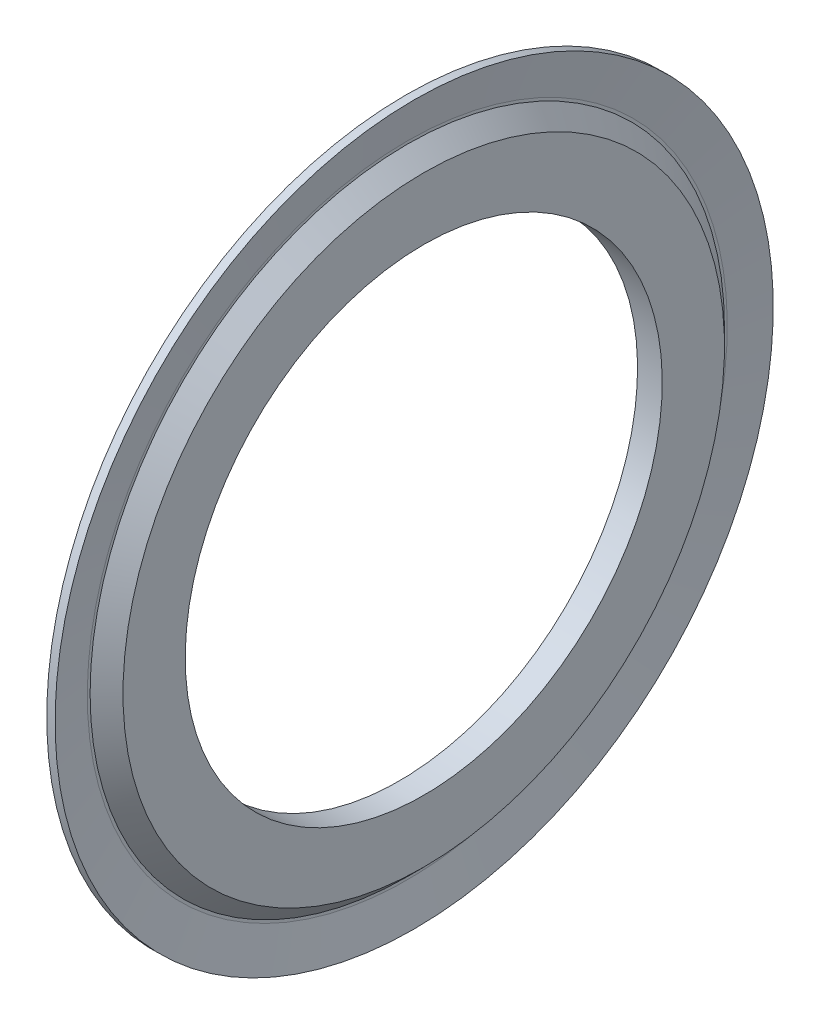
ISO-10303-21;
HEADER;
FILE_DESCRIPTION(('STEP AP214'),'2;1');
FILE_NAME('part.step','',(''),(''),'','','');
FILE_SCHEMA(('AUTOMOTIVE_DESIGN { 1 0 10303 214 1 1 1 1 }'));
ENDSEC;
DATA;
#1=APPLICATION_CONTEXT('core data for automotive mechanical design processes');
#2=APPLICATION_PROTOCOL_DEFINITION('international standard','automotive_design',2000,#1);
#3=PRODUCT_CONTEXT('',#1,'mechanical');
#4=PRODUCT('Part','Part','',(#3));
#5=PRODUCT_RELATED_PRODUCT_CATEGORY('part','',(#4));
#6=PRODUCT_DEFINITION_FORMATION('','',#4);
#7=PRODUCT_DEFINITION_CONTEXT('part definition',#1,'design');
#8=PRODUCT_DEFINITION('design','',#6,#7);
#9=PRODUCT_DEFINITION_SHAPE('','',#8);
#10=(LENGTH_UNIT() NAMED_UNIT(*) SI_UNIT(.MILLI.,.METRE.));
#11=(NAMED_UNIT(*) PLANE_ANGLE_UNIT() SI_UNIT($,.RADIAN.));
#12=(NAMED_UNIT(*) SI_UNIT($,.STERADIAN.) SOLID_ANGLE_UNIT());
#13=UNCERTAINTY_MEASURE_WITH_UNIT(LENGTH_MEASURE(1.E-05),#10,'distance_accuracy_value','');
#14=(GEOMETRIC_REPRESENTATION_CONTEXT(3) GLOBAL_UNCERTAINTY_ASSIGNED_CONTEXT((#13)) GLOBAL_UNIT_ASSIGNED_CONTEXT((#10,
#11,#12)) REPRESENTATION_CONTEXT('',''));
#15=CARTESIAN_POINT('',(0.,0.,0.));
#16=DIRECTION('',(0.,0.,1.));
#17=DIRECTION('',(1.,0.,0.));
#18=AXIS2_PLACEMENT_3D('',#15,#16,#17);
#19=CARTESIAN_POINT('',(5.2371286845165,7.518,0.));
#20=DIRECTION('',(-1.,0.,0.));
#21=DIRECTION('',(0.,-1.,0.));
#22=AXIS2_PLACEMENT_3D('',#19,#20,#21);
#23=PLANE('',#22);
#24=CARTESIAN_POINT('',(5.2371286845165,0.,0.));
#25=DIRECTION('',(1.,0.,0.));
#26=DIRECTION('',(0.,1.,0.));
#27=AXIS2_PLACEMENT_3D('',#24,#25,#26);
#28=CIRCLE('',#27,7.436);
#29=CARTESIAN_POINT('',(5.2371286845165,7.436,0.));
#30=VERTEX_POINT('',#29);
#31=EDGE_CURVE('E11',#30,#30,#28,.T.);
#32=ORIENTED_EDGE('',*,*,#31,.T.);
#33=EDGE_LOOP('',(#32));
#34=FACE_BOUND('',#33,.T.);
#35=CARTESIAN_POINT('',(5.2371286845165,0.,0.));
#36=DIRECTION('',(1.,0.,0.));
#37=DIRECTION('',(0.,1.,0.));
#38=AXIS2_PLACEMENT_3D('',#35,#36,#37);
#39=CIRCLE('',#38,7.6);
#40=CARTESIAN_POINT('',(5.2371286845165,7.6,0.));
#41=VERTEX_POINT('',#40);
#42=EDGE_CURVE('E70',#41,#41,#39,.T.);
#43=ORIENTED_EDGE('',*,*,#42,.F.);
#44=EDGE_LOOP('',(#43));
#45=FACE_BOUND('',#44,.T.);
#46=ADVANCED_FACE('F16',(#34,#45),#23,.T.);
#47=CARTESIAN_POINT('',(5.4321286845165,0.,0.));
#48=DIRECTION('',(-1.,0.,0.));
#49=DIRECTION('',(0.,1.,0.));
#50=AXIS2_PLACEMENT_3D('',#47,#48,#49);
#51=CONICAL_SURFACE('',#50,7.241,0.785398163397447);
#52=CARTESIAN_POINT('',(5.6271286845165,0.,0.));
#53=DIRECTION('',(1.,0.,0.));
#54=DIRECTION('',(0.,1.,0.));
#55=AXIS2_PLACEMENT_3D('',#52,#53,#54);
#56=CIRCLE('',#55,7.046);
#57=CARTESIAN_POINT('',(5.6271286845165,7.046,0.));
#58=VERTEX_POINT('',#57);
#59=EDGE_CURVE('E26',#58,#58,#56,.T.);
#60=ORIENTED_EDGE('',*,*,#59,.T.);
#61=EDGE_LOOP('',(#60));
#62=FACE_BOUND('',#61,.T.);
#63=ORIENTED_EDGE('',*,*,#31,.F.);
#64=EDGE_LOOP('',(#63));
#65=FACE_BOUND('',#64,.T.);
#66=ADVANCED_FACE('F18',(#62,#65),#51,.F.);
#67=CARTESIAN_POINT('',(5.6271286845165,6.44675,0.));
#68=DIRECTION('',(-1.,0.,0.));
#69=DIRECTION('',(0.,-1.,0.));
#70=AXIS2_PLACEMENT_3D('',#67,#68,#69);
#71=PLANE('',#70);
#72=CARTESIAN_POINT('',(5.6271286845165,0.,0.));
#73=DIRECTION('',(1.,0.,0.));
#74=DIRECTION('',(0.,1.,0.));
#75=AXIS2_PLACEMENT_3D('',#72,#73,#74);
#76=CIRCLE('',#75,5.8475);
#77=CARTESIAN_POINT('',(5.6271286845165,5.8475,0.));
#78=VERTEX_POINT('',#77);
#79=EDGE_CURVE('E85',#78,#78,#76,.T.);
#80=ORIENTED_EDGE('',*,*,#79,.T.);
#81=EDGE_LOOP('',(#80));
#82=FACE_BOUND('',#81,.T.);
#83=ORIENTED_EDGE('',*,*,#59,.F.);
#84=EDGE_LOOP('',(#83));
#85=FACE_BOUND('',#84,.T.);
#86=ADVANCED_FACE('F105',(#82,#85),#71,.T.);
#87=CARTESIAN_POINT('',(5.4321286845165,0.,0.));
#88=DIRECTION('',(-1.,0.,0.));
#89=DIRECTION('',(0.,1.,0.));
#90=AXIS2_PLACEMENT_3D('',#87,#88,#89);
#91=CYLINDRICAL_SURFACE('',#90,5.8475);
#92=CARTESIAN_POINT('',(5.2371286845165,0.,0.));
#93=DIRECTION('',(1.,0.,0.));
#94=DIRECTION('',(0.,1.,0.));
#95=AXIS2_PLACEMENT_3D('',#92,#93,#94);
#96=CIRCLE('',#95,5.8475);
#97=CARTESIAN_POINT('',(5.2371286845165,5.8475,0.));
#98=VERTEX_POINT('',#97);
#99=EDGE_CURVE('E86',#98,#98,#96,.T.);
#100=ORIENTED_EDGE('',*,*,#99,.T.);
#101=EDGE_LOOP('',(#100));
#102=FACE_BOUND('',#101,.T.);
#103=ORIENTED_EDGE('',*,*,#79,.F.);
#104=EDGE_LOOP('',(#103));
#105=FACE_BOUND('',#104,.T.);
#106=ADVANCED_FACE('F91',(#102,#105),#91,.T.);
#107=CARTESIAN_POINT('',(5.2371286845165,5.75,0.));
#108=DIRECTION('',(-1.,0.,0.));
#109=DIRECTION('',(0.,-1.,0.));
#110=AXIS2_PLACEMENT_3D('',#107,#108,#109);
#111=PLANE('',#110);
#112=CARTESIAN_POINT('',(5.2371286845165,0.,0.));
#113=DIRECTION('',(1.,0.,0.));
#114=DIRECTION('',(0.,1.,0.));
#115=AXIS2_PLACEMENT_3D('',#112,#113,#114);
#116=CIRCLE('',#115,5.6525);
#117=CARTESIAN_POINT('',(5.2371286845165,5.6525,0.));
#118=VERTEX_POINT('',#117);
#119=EDGE_CURVE('E66',#118,#118,#116,.T.);
#120=ORIENTED_EDGE('',*,*,#119,.T.);
#121=EDGE_LOOP('',(#120));
#122=FACE_BOUND('',#121,.T.);
#123=ORIENTED_EDGE('',*,*,#99,.F.);
#124=EDGE_LOOP('',(#123));
#125=FACE_BOUND('',#124,.T.);
#126=ADVANCED_FACE('F94',(#122,#125),#111,.T.);
#127=CARTESIAN_POINT('',(5.5296286845165,0.,0.));
#128=DIRECTION('',(-1.,0.,0.));
#129=DIRECTION('',(0.,1.,0.));
#130=AXIS2_PLACEMENT_3D('',#127,#128,#129);
#131=CYLINDRICAL_SURFACE('',#130,5.6525);
#132=CARTESIAN_POINT('',(5.8221286845165,0.,0.));
#133=DIRECTION('',(1.,0.,0.));
#134=DIRECTION('',(0.,1.,0.));
#135=AXIS2_PLACEMENT_3D('',#132,#133,#134);
#136=CIRCLE('',#135,5.6525);
#137=CARTESIAN_POINT('',(5.8221286845165,5.6525,0.));
#138=VERTEX_POINT('',#137);
#139=EDGE_CURVE('E63',#138,#138,#136,.T.);
#140=ORIENTED_EDGE('',*,*,#139,.T.);
#141=EDGE_LOOP('',(#140));
#142=FACE_BOUND('',#141,.T.);
#143=ORIENTED_EDGE('',*,*,#119,.F.);
#144=EDGE_LOOP('',(#143));
#145=FACE_BOUND('',#144,.T.);
#146=ADVANCED_FACE('F96',(#142,#145),#131,.F.);
#147=CARTESIAN_POINT('',(5.8221286845165,6.38963582233138,0.));
#148=DIRECTION('',(1.,0.,0.));
#149=DIRECTION('',(0.,1.,0.));
#150=AXIS2_PLACEMENT_3D('',#147,#148,#149);
#151=PLANE('',#150);
#152=CARTESIAN_POINT('',(5.8221286845165,0.,0.));
#153=DIRECTION('',(1.,0.,0.));
#154=DIRECTION('',(0.,1.,0.));
#155=AXIS2_PLACEMENT_3D('',#152,#153,#154);
#156=CIRCLE('',#155,7.12677164466275);
#157=CARTESIAN_POINT('',(5.8221286845165,7.12677164466275,0.));
#158=VERTEX_POINT('',#157);
#159=EDGE_CURVE('E59',#158,#158,#156,.T.);
#160=ORIENTED_EDGE('',*,*,#159,.T.);
#161=EDGE_LOOP('',(#160));
#162=FACE_BOUND('',#161,.T.);
#163=ORIENTED_EDGE('',*,*,#139,.F.);
#164=EDGE_LOOP('',(#163));
#165=FACE_BOUND('',#164,.T.);
#166=ADVANCED_FACE('F60',(#162,#165),#151,.T.);
#167=CARTESIAN_POINT('',(5.6271286845165,0.,0.));
#168=DIRECTION('',(-1.,0.,0.));
#169=DIRECTION('',(0.,1.,0.));
#170=AXIS2_PLACEMENT_3D('',#167,#168,#169);
#171=CONICAL_SURFACE('',#170,7.32177164466275,0.785398163397447);
#172=CARTESIAN_POINT('',(5.4321286845165,0.,0.));
#173=DIRECTION('',(1.,0.,0.));
#174=DIRECTION('',(0.,1.,0.));
#175=AXIS2_PLACEMENT_3D('',#172,#173,#174);
#176=CIRCLE('',#175,7.51677164466275);
#177=CARTESIAN_POINT('',(5.4321286845165,7.51677164466275,0.));
#178=VERTEX_POINT('',#177);
#179=EDGE_CURVE('E64',#178,#178,#176,.T.);
#180=ORIENTED_EDGE('',*,*,#179,.T.);
#181=EDGE_LOOP('',(#180));
#182=FACE_BOUND('',#181,.T.);
#183=ORIENTED_EDGE('',*,*,#159,.F.);
#184=EDGE_LOOP('',(#183));
#185=FACE_BOUND('',#184,.T.);
#186=ADVANCED_FACE('F130',(#182,#185),#171,.T.);
#187=CARTESIAN_POINT('',(5.4321286845165,7.5498556776376,0.));
#188=DIRECTION('',(1.,0.,0.));
#189=DIRECTION('',(0.,1.,0.));
#190=AXIS2_PLACEMENT_3D('',#187,#188,#189);
#191=PLANE('',#190);
#192=CARTESIAN_POINT('',(5.4321286845165,0.,0.));
#193=DIRECTION('',(1.,0.,0.));
#194=DIRECTION('',(0.,1.,0.));
#195=AXIS2_PLACEMENT_3D('',#192,#193,#194);
#196=CIRCLE('',#195,7.58293971061244);
#197=CARTESIAN_POINT('',(5.4321286845165,7.58293971061244,0.));
#198=VERTEX_POINT('',#197);
#199=EDGE_CURVE('E20',#198,#198,#196,.T.);
#200=ORIENTED_EDGE('',*,*,#199,.T.);
#201=EDGE_LOOP('',(#200));
#202=FACE_BOUND('',#201,.T.);
#203=ORIENTED_EDGE('',*,*,#179,.F.);
#204=EDGE_LOOP('',(#203));
#205=FACE_BOUND('',#204,.T.);
#206=ADVANCED_FACE('F122',(#202,#205),#191,.T.);
#207=CARTESIAN_POINT('',(5.51386155539771,0.,0.));
#208=DIRECTION('',(1.,0.,0.));
#209=DIRECTION('',(0.,1.,0.));
#210=AXIS2_PLACEMENT_3D('',#207,#208,#209);
#211=CONICAL_SURFACE('',#210,8.04646985530622,1.39626340159546);
#212=CARTESIAN_POINT('',(5.59559442627892,0.,0.));
#213=DIRECTION('',(1.,0.,0.));
#214=DIRECTION('',(0.,1.,0.));
#215=AXIS2_PLACEMENT_3D('',#212,#213,#214);
#216=CIRCLE('',#215,8.51);
#217=CARTESIAN_POINT('',(5.59559442627892,8.51,0.));
#218=VERTEX_POINT('',#217);
#219=EDGE_CURVE('E76',#218,#218,#216,.T.);
#220=ORIENTED_EDGE('',*,*,#219,.T.);
#221=EDGE_LOOP('',(#220));
#222=FACE_BOUND('',#221,.T.);
#223=ORIENTED_EDGE('',*,*,#199,.F.);
#224=EDGE_LOOP('',(#223));
#225=FACE_BOUND('',#224,.T.);
#226=ADVANCED_FACE('F120',(#222,#225),#211,.F.);
#227=CARTESIAN_POINT('',(5.49659033162006,0.,0.));
#228=DIRECTION('',(-1.,0.,0.));
#229=DIRECTION('',(0.,1.,0.));
#230=AXIS2_PLACEMENT_3D('',#227,#228,#229);
#231=CYLINDRICAL_SURFACE('',#230,8.51);
#232=CARTESIAN_POINT('',(5.3975862369612,0.,0.));
#233=DIRECTION('',(1.,0.,0.));
#234=DIRECTION('',(0.,1.,0.));
#235=AXIS2_PLACEMENT_3D('',#232,#233,#234);
#236=CIRCLE('',#235,8.51);
#237=CARTESIAN_POINT('',(5.3975862369612,8.51,0.));
#238=VERTEX_POINT('',#237);
#239=EDGE_CURVE('E72',#238,#238,#236,.T.);
#240=ORIENTED_EDGE('',*,*,#239,.T.);
#241=EDGE_LOOP('',(#240));
#242=FACE_BOUND('',#241,.T.);
#243=ORIENTED_EDGE('',*,*,#219,.F.);
#244=EDGE_LOOP('',(#243));
#245=FACE_BOUND('',#244,.T.);
#246=ADVANCED_FACE('F119',(#242,#245),#231,.T.);
#247=CARTESIAN_POINT('',(5.31735746073885,0.,0.));
#248=DIRECTION('',(1.,0.,0.));
#249=DIRECTION('',(0.,1.,0.));
#250=AXIS2_PLACEMENT_3D('',#247,#248,#249);
#251=CONICAL_SURFACE('',#250,8.055,1.39626340159546);
#252=ORIENTED_EDGE('',*,*,#42,.T.);
#253=EDGE_LOOP('',(#252));
#254=FACE_BOUND('',#253,.T.);
#255=ORIENTED_EDGE('',*,*,#239,.F.);
#256=EDGE_LOOP('',(#255));
#257=FACE_BOUND('',#256,.T.);
#258=ADVANCED_FACE('F116',(#254,#257),#251,.T.);
#259=CLOSED_SHELL('',(#46,#66,#86,#106,#126,#146,#166,#186,#206,#226,#246,#258));
#260=MANIFOLD_SOLID_BREP('B1',#259);
#261=ADVANCED_BREP_SHAPE_REPRESENTATION('',(#18,#260),#14);
#262=SHAPE_DEFINITION_REPRESENTATION(#9,#261);
ENDSEC;
END-ISO-10303-21;
